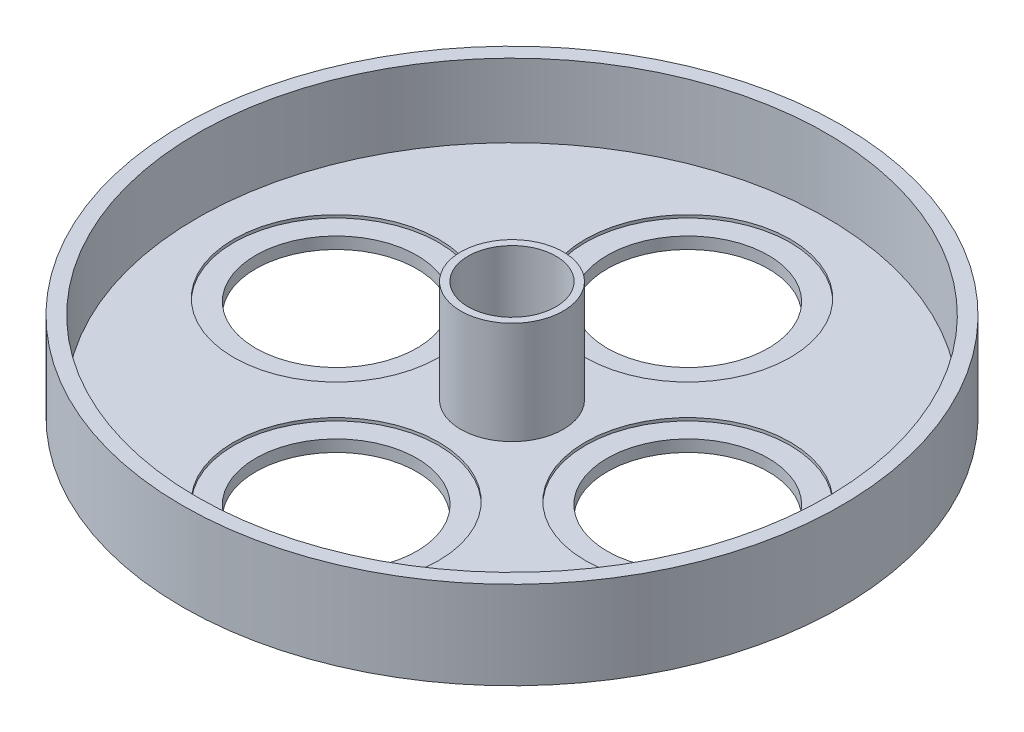
ISO-10303-21;
HEADER;
FILE_DESCRIPTION(('STEP AP214'),'2;1');
FILE_NAME('part.step','',(''),(''),'','','');
FILE_SCHEMA(('AUTOMOTIVE_DESIGN { 1 0 10303 214 1 1 1 1 }'));
ENDSEC;
DATA;
#1=APPLICATION_CONTEXT('core data for automotive mechanical design processes');
#2=APPLICATION_PROTOCOL_DEFINITION('international standard','automotive_design',2000,#1);
#3=PRODUCT_CONTEXT('',#1,'mechanical');
#4=PRODUCT('Part','Part','',(#3));
#5=PRODUCT_RELATED_PRODUCT_CATEGORY('part','',(#4));
#6=PRODUCT_DEFINITION_FORMATION('','',#4);
#7=PRODUCT_DEFINITION_CONTEXT('part definition',#1,'design');
#8=PRODUCT_DEFINITION('design','',#6,#7);
#9=PRODUCT_DEFINITION_SHAPE('','',#8);
#10=(LENGTH_UNIT() NAMED_UNIT(*) SI_UNIT(.MILLI.,.METRE.));
#11=(NAMED_UNIT(*) PLANE_ANGLE_UNIT() SI_UNIT($,.RADIAN.));
#12=(NAMED_UNIT(*) SI_UNIT($,.STERADIAN.) SOLID_ANGLE_UNIT());
#13=UNCERTAINTY_MEASURE_WITH_UNIT(LENGTH_MEASURE(1.E-05),#10,'distance_accuracy_value','');
#14=(GEOMETRIC_REPRESENTATION_CONTEXT(3) GLOBAL_UNCERTAINTY_ASSIGNED_CONTEXT((#13)) GLOBAL_UNIT_ASSIGNED_CONTEXT((#10,
#11,#12)) REPRESENTATION_CONTEXT('',''));
#15=CARTESIAN_POINT('',(0.,0.,0.));
#16=DIRECTION('',(0.,0.,1.));
#17=DIRECTION('',(1.,0.,0.));
#18=AXIS2_PLACEMENT_3D('',#15,#16,#17);
#19=CARTESIAN_POINT('',(0.,80.,0.));
#20=DIRECTION('',(0.,1.,0.));
#21=DIRECTION('',(0.,0.,1.));
#22=AXIS2_PLACEMENT_3D('',#19,#20,#21);
#23=PLANE('',#22);
#24=CARTESIAN_POINT('',(0.,80.,0.));
#25=DIRECTION('',(0.,1.,0.));
#26=DIRECTION('',(0.,0.,1.));
#27=AXIS2_PLACEMENT_3D('',#24,#25,#26);
#28=CIRCLE('',#27,35.);
#29=CARTESIAN_POINT('',(0.,80.,35.));
#30=VERTEX_POINT('',#29);
#31=EDGE_CURVE('E11',#30,#30,#28,.T.);
#32=ORIENTED_EDGE('',*,*,#31,.T.);
#33=EDGE_LOOP('',(#32));
#34=FACE_BOUND('',#33,.T.);
#35=CARTESIAN_POINT('',(0.,80.,0.));
#36=DIRECTION('',(0.,1.,0.));
#37=DIRECTION('',(0.,0.,1.));
#38=AXIS2_PLACEMENT_3D('',#35,#36,#37);
#39=CIRCLE('',#38,30.);
#40=CARTESIAN_POINT('',(0.,80.,30.));
#41=VERTEX_POINT('',#40);
#42=EDGE_CURVE('E60',#41,#41,#39,.T.);
#43=ORIENTED_EDGE('',*,*,#42,.F.);
#44=EDGE_LOOP('',(#43));
#45=FACE_BOUND('',#44,.T.);
#46=ADVANCED_FACE('F49',(#34,#45),#23,.T.);
#47=CARTESIAN_POINT('',(0.,10.,0.));
#48=DIRECTION('',(0.,1.,0.));
#49=DIRECTION('',(0.,0.,1.));
#50=AXIS2_PLACEMENT_3D('',#47,#48,#49);
#51=PLANE('',#50);
#52=CARTESIAN_POINT('',(0.,10.,0.));
#53=DIRECTION('',(0.,1.,0.));
#54=DIRECTION('',(0.,0.,1.));
#55=AXIS2_PLACEMENT_3D('',#52,#53,#54);
#56=CIRCLE('',#55,35.);
#57=CARTESIAN_POINT('',(0.,10.,35.));
#58=VERTEX_POINT('',#57);
#59=EDGE_CURVE('E53',#58,#58,#56,.T.);
#60=ORIENTED_EDGE('',*,*,#59,.F.);
#61=EDGE_LOOP('',(#60));
#62=FACE_BOUND('',#61,.T.);
#63=CARTESIAN_POINT('',(0.,10.,0.));
#64=DIRECTION('',(0.,1.,0.));
#65=DIRECTION('',(0.,0.,1.));
#66=AXIS2_PLACEMENT_3D('',#63,#64,#65);
#67=CIRCLE('',#66,30.);
#68=CARTESIAN_POINT('',(0.,10.,30.));
#69=VERTEX_POINT('',#68);
#70=EDGE_CURVE('E62',#69,#69,#67,.T.);
#71=ORIENTED_EDGE('',*,*,#70,.T.);
#72=EDGE_LOOP('',(#71));
#73=FACE_BOUND('',#72,.T.);
#74=ADVANCED_FACE('F72',(#62,#73),#51,.F.);
#75=CARTESIAN_POINT('',(0.,80.,0.));
#76=DIRECTION('',(0.,-1.,0.));
#77=DIRECTION('',(0.,0.,-1.));
#78=AXIS2_PLACEMENT_3D('',#75,#76,#77);
#79=CYLINDRICAL_SURFACE('',#78,35.);
#80=ORIENTED_EDGE('',*,*,#31,.F.);
#81=EDGE_LOOP('',(#80));
#82=FACE_BOUND('',#81,.T.);
#83=ORIENTED_EDGE('',*,*,#59,.T.);
#84=EDGE_LOOP('',(#83));
#85=FACE_BOUND('',#84,.T.);
#86=ADVANCED_FACE('F51',(#82,#85),#79,.T.);
#87=CARTESIAN_POINT('',(0.,80.,0.));
#88=DIRECTION('',(0.,-1.,0.));
#89=DIRECTION('',(0.,0.,-1.));
#90=AXIS2_PLACEMENT_3D('',#87,#88,#89);
#91=CYLINDRICAL_SURFACE('',#90,30.);
#92=ORIENTED_EDGE('',*,*,#42,.T.);
#93=EDGE_LOOP('',(#92));
#94=FACE_BOUND('',#93,.T.);
#95=ORIENTED_EDGE('',*,*,#70,.F.);
#96=EDGE_LOOP('',(#95));
#97=FACE_BOUND('',#96,.T.);
#98=ADVANCED_FACE('F68',(#94,#97),#91,.F.);
#99=CLOSED_SHELL('',(#46,#74,#86,#98));
#100=MANIFOLD_SOLID_BREP('B2',#99);
#101=CARTESIAN_POINT('',(0.,10.,-120.));
#102=DIRECTION('',(0.,-1.,0.));
#103=DIRECTION('',(0.,0.,-1.));
#104=AXIS2_PLACEMENT_3D('',#101,#102,#103);
#105=CYLINDRICAL_SURFACE('',#104,55.);
#106=CARTESIAN_POINT('',(0.,0.,-120.));
#107=DIRECTION('',(0.,1.,0.));
#108=DIRECTION('',(0.,0.,1.));
#109=AXIS2_PLACEMENT_3D('',#106,#107,#108);
#110=CIRCLE('',#109,55.);
#111=CARTESIAN_POINT('',(0.,0.,-65.));
#112=VERTEX_POINT('',#111);
#113=EDGE_CURVE('E134',#112,#112,#110,.T.);
#114=ORIENTED_EDGE('',*,*,#113,.F.);
#115=EDGE_LOOP('',(#114));
#116=FACE_BOUND('',#115,.T.);
#117=CARTESIAN_POINT('',(0.,8.,-120.));
#118=DIRECTION('',(0.,1.,0.));
#119=DIRECTION('',(0.,0.,1.));
#120=AXIS2_PLACEMENT_3D('',#117,#118,#119);
#121=CIRCLE('',#120,55.);
#122=CARTESIAN_POINT('',(0.,8.,-65.));
#123=VERTEX_POINT('',#122);
#124=EDGE_CURVE('E123',#123,#123,#121,.T.);
#125=ORIENTED_EDGE('',*,*,#124,.T.);
#126=EDGE_LOOP('',(#125));
#127=FACE_BOUND('',#126,.T.);
#128=ADVANCED_FACE('F119',(#116,#127),#105,.F.);
#129=CARTESIAN_POINT('',(120.,10.,0.));
#130=DIRECTION('',(0.,-1.,0.));
#131=DIRECTION('',(0.,0.,-1.));
#132=AXIS2_PLACEMENT_3D('',#129,#130,#131);
#133=CYLINDRICAL_SURFACE('',#132,55.);
#134=CARTESIAN_POINT('',(120.,0.,0.));
#135=DIRECTION('',(0.,1.,0.));
#136=DIRECTION('',(0.,0.,1.));
#137=AXIS2_PLACEMENT_3D('',#134,#135,#136);
#138=CIRCLE('',#137,55.);
#139=CARTESIAN_POINT('',(120.,0.,55.));
#140=VERTEX_POINT('',#139);
#141=EDGE_CURVE('E177',#140,#140,#138,.T.);
#142=ORIENTED_EDGE('',*,*,#141,.F.);
#143=EDGE_LOOP('',(#142));
#144=FACE_BOUND('',#143,.T.);
#145=CARTESIAN_POINT('',(120.,8.,0.));
#146=DIRECTION('',(0.,1.,0.));
#147=DIRECTION('',(0.,0.,1.));
#148=AXIS2_PLACEMENT_3D('',#145,#146,#147);
#149=CIRCLE('',#148,55.);
#150=CARTESIAN_POINT('',(120.,8.,55.));
#151=VERTEX_POINT('',#150);
#152=EDGE_CURVE('E146',#151,#151,#149,.T.);
#153=ORIENTED_EDGE('',*,*,#152,.T.);
#154=EDGE_LOOP('',(#153));
#155=FACE_BOUND('',#154,.T.);
#156=ADVANCED_FACE('F196',(#144,#155),#133,.F.);
#157=CARTESIAN_POINT('',(0.,10.,120.));
#158=DIRECTION('',(0.,-1.,0.));
#159=DIRECTION('',(0.,0.,-1.));
#160=AXIS2_PLACEMENT_3D('',#157,#158,#159);
#161=CYLINDRICAL_SURFACE('',#160,55.);
#162=CARTESIAN_POINT('',(0.,0.,120.));
#163=DIRECTION('',(0.,1.,0.));
#164=DIRECTION('',(0.,0.,1.));
#165=AXIS2_PLACEMENT_3D('',#162,#163,#164);
#166=CIRCLE('',#165,55.);
#167=CARTESIAN_POINT('',(0.,0.,175.));
#168=VERTEX_POINT('',#167);
#169=EDGE_CURVE('E173',#168,#168,#166,.T.);
#170=ORIENTED_EDGE('',*,*,#169,.F.);
#171=EDGE_LOOP('',(#170));
#172=FACE_BOUND('',#171,.T.);
#173=CARTESIAN_POINT('',(0.,8.,120.));
#174=DIRECTION('',(0.,1.,0.));
#175=DIRECTION('',(0.,0.,1.));
#176=AXIS2_PLACEMENT_3D('',#173,#174,#175);
#177=CIRCLE('',#176,55.);
#178=CARTESIAN_POINT('',(0.,8.,175.));
#179=VERTEX_POINT('',#178);
#180=EDGE_CURVE('E142',#179,#179,#177,.T.);
#181=ORIENTED_EDGE('',*,*,#180,.T.);
#182=EDGE_LOOP('',(#181));
#183=FACE_BOUND('',#182,.T.);
#184=ADVANCED_FACE('F201',(#172,#183),#161,.F.);
#185=CARTESIAN_POINT('',(-120.,10.,0.));
#186=DIRECTION('',(0.,-1.,0.));
#187=DIRECTION('',(0.,0.,-1.));
#188=AXIS2_PLACEMENT_3D('',#185,#186,#187);
#189=CYLINDRICAL_SURFACE('',#188,55.);
#190=CARTESIAN_POINT('',(-120.,0.,0.));
#191=DIRECTION('',(0.,1.,0.));
#192=DIRECTION('',(0.,0.,1.));
#193=AXIS2_PLACEMENT_3D('',#190,#191,#192);
#194=CIRCLE('',#193,55.);
#195=CARTESIAN_POINT('',(-120.,0.,55.));
#196=VERTEX_POINT('',#195);
#197=EDGE_CURVE('E164',#196,#196,#194,.T.);
#198=ORIENTED_EDGE('',*,*,#197,.F.);
#199=EDGE_LOOP('',(#198));
#200=FACE_BOUND('',#199,.T.);
#201=CARTESIAN_POINT('',(-120.,8.,0.));
#202=DIRECTION('',(0.,1.,0.));
#203=DIRECTION('',(0.,0.,1.));
#204=AXIS2_PLACEMENT_3D('',#201,#202,#203);
#205=CIRCLE('',#204,55.);
#206=CARTESIAN_POINT('',(-120.,8.,55.));
#207=VERTEX_POINT('',#206);
#208=EDGE_CURVE('E138',#207,#207,#205,.T.);
#209=ORIENTED_EDGE('',*,*,#208,.T.);
#210=EDGE_LOOP('',(#209));
#211=FACE_BOUND('',#210,.T.);
#212=ADVANCED_FACE('F209',(#200,#211),#189,.F.);
#213=CARTESIAN_POINT('',(0.,10.,0.));
#214=DIRECTION('',(0.,1.,0.));
#215=DIRECTION('',(0.,0.,1.));
#216=AXIS2_PLACEMENT_3D('',#213,#214,#215);
#217=PLANE('',#216);
#218=CARTESIAN_POINT('',(0.,10.,120.));
#219=DIRECTION('',(0.,1.,0.));
#220=DIRECTION('',(0.,0.,1.));
#221=AXIS2_PLACEMENT_3D('',#218,#219,#220);
#222=CIRCLE('',#221,70.);
#223=CARTESIAN_POINT('',(0.,10.,190.));
#224=VERTEX_POINT('',#223);
#225=EDGE_CURVE('E257',#224,#224,#222,.T.);
#226=ORIENTED_EDGE('',*,*,#225,.F.);
#227=EDGE_LOOP('',(#226));
#228=FACE_BOUND('',#227,.T.);
#229=CARTESIAN_POINT('',(120.,10.,0.));
#230=DIRECTION('',(0.,1.,0.));
#231=DIRECTION('',(0.,0.,1.));
#232=AXIS2_PLACEMENT_3D('',#229,#230,#231);
#233=CIRCLE('',#232,70.);
#234=CARTESIAN_POINT('',(120.,10.,70.));
#235=VERTEX_POINT('',#234);
#236=EDGE_CURVE('E270',#235,#235,#233,.T.);
#237=ORIENTED_EDGE('',*,*,#236,.F.);
#238=EDGE_LOOP('',(#237));
#239=FACE_BOUND('',#238,.T.);
#240=CARTESIAN_POINT('',(-120.,10.,0.));
#241=DIRECTION('',(0.,1.,0.));
#242=DIRECTION('',(0.,0.,1.));
#243=AXIS2_PLACEMENT_3D('',#240,#241,#242);
#244=CIRCLE('',#243,70.);
#245=CARTESIAN_POINT('',(-120.,10.,70.));
#246=VERTEX_POINT('',#245);
#247=EDGE_CURVE('E258',#246,#246,#244,.T.);
#248=ORIENTED_EDGE('',*,*,#247,.F.);
#249=EDGE_LOOP('',(#248));
#250=FACE_BOUND('',#249,.T.);
#251=CARTESIAN_POINT('',(0.,10.,-120.));
#252=DIRECTION('',(0.,1.,0.));
#253=DIRECTION('',(0.,0.,1.));
#254=AXIS2_PLACEMENT_3D('',#251,#252,#253);
#255=CIRCLE('',#254,70.);
#256=CARTESIAN_POINT('',(0.,10.,-50.));
#257=VERTEX_POINT('',#256);
#258=EDGE_CURVE('E167',#257,#257,#255,.T.);
#259=ORIENTED_EDGE('',*,*,#258,.F.);
#260=EDGE_LOOP('',(#259));
#261=FACE_BOUND('',#260,.T.);
#262=CARTESIAN_POINT('',(0.,10.,0.));
#263=DIRECTION('',(0.,1.,0.));
#264=DIRECTION('',(0.,0.,1.));
#265=AXIS2_PLACEMENT_3D('',#262,#263,#264);
#266=CIRCLE('',#265,35.);
#267=CARTESIAN_POINT('',(0.,10.,35.));
#268=VERTEX_POINT('',#267);
#269=EDGE_CURVE('E182',#268,#268,#266,.T.);
#270=ORIENTED_EDGE('',*,*,#269,.F.);
#271=EDGE_LOOP('',(#270));
#272=FACE_BOUND('',#271,.T.);
#273=CARTESIAN_POINT('',(0.,10.,0.));
#274=DIRECTION('',(0.,1.,0.));
#275=DIRECTION('',(0.,0.,1.));
#276=AXIS2_PLACEMENT_3D('',#273,#274,#275);
#277=CIRCLE('',#276,215.);
#278=CARTESIAN_POINT('',(0.,10.,215.));
#279=VERTEX_POINT('',#278);
#280=EDGE_CURVE('E48',#279,#279,#277,.F.);
#281=ORIENTED_EDGE('',*,*,#280,.F.);
#282=EDGE_LOOP('',(#281));
#283=FACE_BOUND('',#282,.T.);
#284=ADVANCED_FACE('F207',(#228,#239,#250,#261,#272,#283),#217,.T.);
#285=CARTESIAN_POINT('',(0.,0.,0.));
#286=DIRECTION('',(0.,1.,0.));
#287=DIRECTION('',(0.,0.,1.));
#288=AXIS2_PLACEMENT_3D('',#285,#286,#287);
#289=PLANE('',#288);
#290=CARTESIAN_POINT('',(0.,0.,0.));
#291=DIRECTION('',(0.,1.,0.));
#292=DIRECTION('',(0.,0.,1.));
#293=AXIS2_PLACEMENT_3D('',#290,#291,#292);
#294=CIRCLE('',#293,225.);
#295=CARTESIAN_POINT('',(0.,0.,225.));
#296=VERTEX_POINT('',#295);
#297=EDGE_CURVE('E128',#296,#296,#294,.T.);
#298=ORIENTED_EDGE('',*,*,#297,.F.);
#299=EDGE_LOOP('',(#298));
#300=FACE_BOUND('',#299,.T.);
#301=ORIENTED_EDGE('',*,*,#113,.T.);
#302=EDGE_LOOP('',(#301));
#303=FACE_BOUND('',#302,.T.);
#304=CARTESIAN_POINT('',(0.,0.,0.));
#305=DIRECTION('',(0.,1.,0.));
#306=DIRECTION('',(0.,0.,1.));
#307=AXIS2_PLACEMENT_3D('',#304,#305,#306);
#308=CIRCLE('',#307,35.);
#309=CARTESIAN_POINT('',(0.,0.,35.));
#310=VERTEX_POINT('',#309);
#311=EDGE_CURVE('E181',#310,#310,#308,.T.);
#312=ORIENTED_EDGE('',*,*,#311,.T.);
#313=EDGE_LOOP('',(#312));
#314=FACE_BOUND('',#313,.T.);
#315=ORIENTED_EDGE('',*,*,#141,.T.);
#316=EDGE_LOOP('',(#315));
#317=FACE_BOUND('',#316,.T.);
#318=ORIENTED_EDGE('',*,*,#169,.T.);
#319=EDGE_LOOP('',(#318));
#320=FACE_BOUND('',#319,.T.);
#321=ORIENTED_EDGE('',*,*,#197,.T.);
#322=EDGE_LOOP('',(#321));
#323=FACE_BOUND('',#322,.T.);
#324=ADVANCED_FACE('F192',(#300,#303,#314,#317,#320,#323),#289,.F.);
#325=CARTESIAN_POINT('',(0.,10.,0.));
#326=DIRECTION('',(0.,-1.,0.));
#327=DIRECTION('',(0.,0.,-1.));
#328=AXIS2_PLACEMENT_3D('',#325,#326,#327);
#329=CYLINDRICAL_SURFACE('',#328,225.);
#330=ORIENTED_EDGE('',*,*,#297,.T.);
#331=EDGE_LOOP('',(#330));
#332=FACE_BOUND('',#331,.T.);
#333=CARTESIAN_POINT('',(0.,60.,0.));
#334=DIRECTION('',(0.,1.,0.));
#335=DIRECTION('',(0.,0.,1.));
#336=AXIS2_PLACEMENT_3D('',#333,#334,#335);
#337=CIRCLE('',#336,225.);
#338=CARTESIAN_POINT('',(0.,60.,225.));
#339=VERTEX_POINT('',#338);
#340=EDGE_CURVE('E158',#339,#339,#337,.T.);
#341=ORIENTED_EDGE('',*,*,#340,.F.);
#342=EDGE_LOOP('',(#341));
#343=FACE_BOUND('',#342,.T.);
#344=ADVANCED_FACE('F121',(#332,#343),#329,.T.);
#345=CARTESIAN_POINT('',(0.,10.,0.));
#346=DIRECTION('',(0.,-1.,0.));
#347=DIRECTION('',(0.,0.,-1.));
#348=AXIS2_PLACEMENT_3D('',#345,#346,#347);
#349=CYLINDRICAL_SURFACE('',#348,35.);
#350=ORIENTED_EDGE('',*,*,#269,.T.);
#351=EDGE_LOOP('',(#350));
#352=FACE_BOUND('',#351,.T.);
#353=ORIENTED_EDGE('',*,*,#311,.F.);
#354=EDGE_LOOP('',(#353));
#355=FACE_BOUND('',#354,.T.);
#356=ADVANCED_FACE('F206',(#352,#355),#349,.F.);
#357=CARTESIAN_POINT('',(0.,60.,0.));
#358=DIRECTION('',(0.,1.,0.));
#359=DIRECTION('',(0.,0.,1.));
#360=AXIS2_PLACEMENT_3D('',#357,#358,#359);
#361=PLANE('',#360);
#362=ORIENTED_EDGE('',*,*,#340,.T.);
#363=EDGE_LOOP('',(#362));
#364=FACE_BOUND('',#363,.T.);
#365=CARTESIAN_POINT('',(0.,60.,0.));
#366=DIRECTION('',(0.,1.,0.));
#367=DIRECTION('',(0.,0.,1.));
#368=AXIS2_PLACEMENT_3D('',#365,#366,#367);
#369=CIRCLE('',#368,215.);
#370=CARTESIAN_POINT('',(0.,60.,215.));
#371=VERTEX_POINT('',#370);
#372=EDGE_CURVE('E153',#371,#371,#369,.T.);
#373=ORIENTED_EDGE('',*,*,#372,.F.);
#374=EDGE_LOOP('',(#373));
#375=FACE_BOUND('',#374,.T.);
#376=ADVANCED_FACE('F221',(#364,#375),#361,.T.);
#377=CARTESIAN_POINT('',(0.,60.,0.));
#378=DIRECTION('',(0.,-1.,0.));
#379=DIRECTION('',(0.,0.,-1.));
#380=AXIS2_PLACEMENT_3D('',#377,#378,#379);
#381=CYLINDRICAL_SURFACE('',#380,215.);
#382=ORIENTED_EDGE('',*,*,#372,.T.);
#383=EDGE_LOOP('',(#382));
#384=FACE_BOUND('',#383,.T.);
#385=ORIENTED_EDGE('',*,*,#280,.T.);
#386=EDGE_LOOP('',(#385));
#387=FACE_BOUND('',#386,.T.);
#388=ADVANCED_FACE('F224',(#384,#387),#381,.F.);
#389=CARTESIAN_POINT('',(-120.,8.,0.));
#390=DIRECTION('',(0.,1.,0.));
#391=DIRECTION('',(0.,0.,1.));
#392=AXIS2_PLACEMENT_3D('',#389,#390,#391);
#393=CYLINDRICAL_SURFACE('',#392,70.);
#394=CARTESIAN_POINT('',(-120.,8.,0.));
#395=DIRECTION('',(0.,1.,0.));
#396=DIRECTION('',(0.,0.,1.));
#397=AXIS2_PLACEMENT_3D('',#394,#395,#396);
#398=CIRCLE('',#397,70.);
#399=CARTESIAN_POINT('',(-120.,8.,70.));
#400=VERTEX_POINT('',#399);
#401=EDGE_CURVE('E266',#400,#400,#398,.T.);
#402=ORIENTED_EDGE('',*,*,#401,.F.);
#403=EDGE_LOOP('',(#402));
#404=FACE_BOUND('',#403,.T.);
#405=ORIENTED_EDGE('',*,*,#247,.T.);
#406=EDGE_LOOP('',(#405));
#407=FACE_BOUND('',#406,.T.);
#408=ADVANCED_FACE('F230',(#404,#407),#393,.F.);
#409=CARTESIAN_POINT('',(-120.,8.,0.));
#410=DIRECTION('',(0.,1.,0.));
#411=DIRECTION('',(0.,0.,1.));
#412=AXIS2_PLACEMENT_3D('',#409,#410,#411);
#413=PLANE('',#412);
#414=ORIENTED_EDGE('',*,*,#208,.F.);
#415=EDGE_LOOP('',(#414));
#416=FACE_BOUND('',#415,.T.);
#417=ORIENTED_EDGE('',*,*,#401,.T.);
#418=EDGE_LOOP('',(#417));
#419=FACE_BOUND('',#418,.T.);
#420=ADVANCED_FACE('F299',(#416,#419),#413,.T.);
#421=CARTESIAN_POINT('',(0.,8.,120.));
#422=DIRECTION('',(0.,1.,0.));
#423=DIRECTION('',(0.,0.,1.));
#424=AXIS2_PLACEMENT_3D('',#421,#422,#423);
#425=CYLINDRICAL_SURFACE('',#424,70.);
#426=CARTESIAN_POINT('',(0.,8.,120.));
#427=DIRECTION('',(0.,1.,0.));
#428=DIRECTION('',(0.,0.,1.));
#429=AXIS2_PLACEMENT_3D('',#426,#427,#428);
#430=CIRCLE('',#429,70.);
#431=CARTESIAN_POINT('',(0.,8.,190.));
#432=VERTEX_POINT('',#431);
#433=EDGE_CURVE('E254',#432,#432,#430,.T.);
#434=ORIENTED_EDGE('',*,*,#433,.F.);
#435=EDGE_LOOP('',(#434));
#436=FACE_BOUND('',#435,.T.);
#437=ORIENTED_EDGE('',*,*,#225,.T.);
#438=EDGE_LOOP('',(#437));
#439=FACE_BOUND('',#438,.T.);
#440=ADVANCED_FACE('F250',(#436,#439),#425,.F.);
#441=CARTESIAN_POINT('',(0.,8.,120.));
#442=DIRECTION('',(0.,1.,0.));
#443=DIRECTION('',(0.,0.,1.));
#444=AXIS2_PLACEMENT_3D('',#441,#442,#443);
#445=PLANE('',#444);
#446=ORIENTED_EDGE('',*,*,#180,.F.);
#447=EDGE_LOOP('',(#446));
#448=FACE_BOUND('',#447,.T.);
#449=ORIENTED_EDGE('',*,*,#433,.T.);
#450=EDGE_LOOP('',(#449));
#451=FACE_BOUND('',#450,.T.);
#452=ADVANCED_FACE('F246',(#448,#451),#445,.T.);
#453=CARTESIAN_POINT('',(120.,8.,0.));
#454=DIRECTION('',(0.,1.,0.));
#455=DIRECTION('',(0.,0.,1.));
#456=AXIS2_PLACEMENT_3D('',#453,#454,#455);
#457=CYLINDRICAL_SURFACE('',#456,70.);
#458=CARTESIAN_POINT('',(120.,8.,0.));
#459=DIRECTION('',(0.,1.,0.));
#460=DIRECTION('',(0.,0.,1.));
#461=AXIS2_PLACEMENT_3D('',#458,#459,#460);
#462=CIRCLE('',#461,70.);
#463=CARTESIAN_POINT('',(120.,8.,70.));
#464=VERTEX_POINT('',#463);
#465=EDGE_CURVE('E263',#464,#464,#462,.T.);
#466=ORIENTED_EDGE('',*,*,#465,.F.);
#467=EDGE_LOOP('',(#466));
#468=FACE_BOUND('',#467,.T.);
#469=ORIENTED_EDGE('',*,*,#236,.T.);
#470=EDGE_LOOP('',(#469));
#471=FACE_BOUND('',#470,.T.);
#472=ADVANCED_FACE('F249',(#468,#471),#457,.F.);
#473=CARTESIAN_POINT('',(120.,8.,0.));
#474=DIRECTION('',(0.,1.,0.));
#475=DIRECTION('',(0.,0.,1.));
#476=AXIS2_PLACEMENT_3D('',#473,#474,#475);
#477=PLANE('',#476);
#478=ORIENTED_EDGE('',*,*,#152,.F.);
#479=EDGE_LOOP('',(#478));
#480=FACE_BOUND('',#479,.T.);
#481=ORIENTED_EDGE('',*,*,#465,.T.);
#482=EDGE_LOOP('',(#481));
#483=FACE_BOUND('',#482,.T.);
#484=ADVANCED_FACE('F319',(#480,#483),#477,.T.);
#485=CARTESIAN_POINT('',(0.,8.,-120.));
#486=DIRECTION('',(0.,1.,0.));
#487=DIRECTION('',(0.,0.,1.));
#488=AXIS2_PLACEMENT_3D('',#485,#486,#487);
#489=CYLINDRICAL_SURFACE('',#488,70.);
#490=CARTESIAN_POINT('',(0.,8.,-120.));
#491=DIRECTION('',(0.,1.,0.));
#492=DIRECTION('',(0.,0.,1.));
#493=AXIS2_PLACEMENT_3D('',#490,#491,#492);
#494=CIRCLE('',#493,70.);
#495=CARTESIAN_POINT('',(0.,8.,-50.));
#496=VERTEX_POINT('',#495);
#497=EDGE_CURVE('E143',#496,#496,#494,.T.);
#498=ORIENTED_EDGE('',*,*,#497,.F.);
#499=EDGE_LOOP('',(#498));
#500=FACE_BOUND('',#499,.T.);
#501=ORIENTED_EDGE('',*,*,#258,.T.);
#502=EDGE_LOOP('',(#501));
#503=FACE_BOUND('',#502,.T.);
#504=ADVANCED_FACE('F284',(#500,#503),#489,.F.);
#505=CARTESIAN_POINT('',(0.,8.,-120.));
#506=DIRECTION('',(0.,1.,0.));
#507=DIRECTION('',(0.,0.,1.));
#508=AXIS2_PLACEMENT_3D('',#505,#506,#507);
#509=PLANE('',#508);
#510=ORIENTED_EDGE('',*,*,#124,.F.);
#511=EDGE_LOOP('',(#510));
#512=FACE_BOUND('',#511,.T.);
#513=ORIENTED_EDGE('',*,*,#497,.T.);
#514=EDGE_LOOP('',(#513));
#515=FACE_BOUND('',#514,.T.);
#516=ADVANCED_FACE('F324',(#512,#515),#509,.T.);
#517=CLOSED_SHELL('',(#128,#156,#184,#212,#284,#324,#344,#356,#376,#388,#408,#420,#440,#452,
#472,#484,#504,#516));
#518=MANIFOLD_SOLID_BREP('B6',#517);
#519=ADVANCED_BREP_SHAPE_REPRESENTATION('',(#18,#100,#518),#14);
#520=SHAPE_DEFINITION_REPRESENTATION(#9,#519);
ENDSEC;
END-ISO-10303-21;
